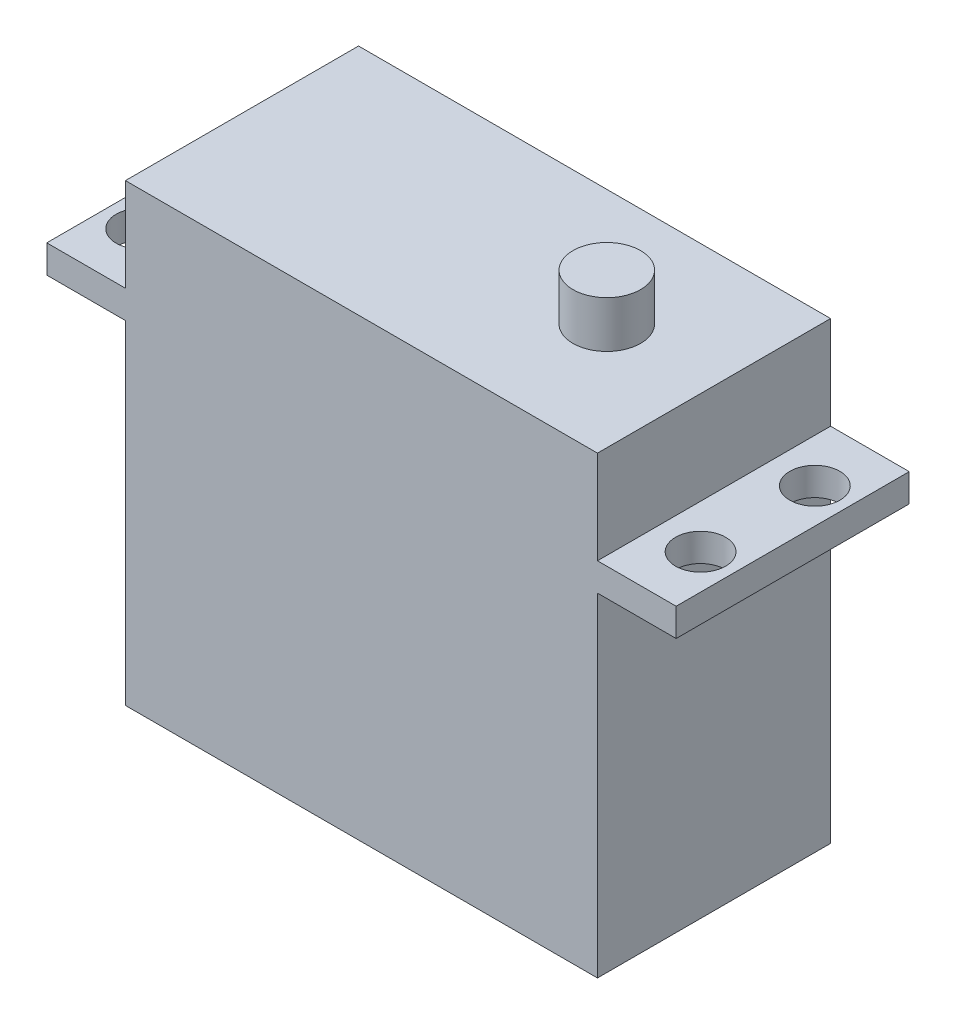
ISO-10303-21;
HEADER;
FILE_DESCRIPTION(('STEP AP214'),'2;1');
FILE_NAME('part.step','',(''),(''),'','','');
FILE_SCHEMA(('AUTOMOTIVE_DESIGN { 1 0 10303 214 1 1 1 1 }'));
ENDSEC;
DATA;
#1=APPLICATION_CONTEXT('core data for automotive mechanical design processes');
#2=APPLICATION_PROTOCOL_DEFINITION('international standard','automotive_design',2000,#1);
#3=PRODUCT_CONTEXT('',#1,'mechanical');
#4=PRODUCT('Part','Part','',(#3));
#5=PRODUCT_RELATED_PRODUCT_CATEGORY('part','',(#4));
#6=PRODUCT_DEFINITION_FORMATION('','',#4);
#7=PRODUCT_DEFINITION_CONTEXT('part definition',#1,'design');
#8=PRODUCT_DEFINITION('design','',#6,#7);
#9=PRODUCT_DEFINITION_SHAPE('','',#8);
#10=(LENGTH_UNIT() NAMED_UNIT(*) SI_UNIT(.MILLI.,.METRE.));
#11=(NAMED_UNIT(*) PLANE_ANGLE_UNIT() SI_UNIT($,.RADIAN.));
#12=(NAMED_UNIT(*) SI_UNIT($,.STERADIAN.) SOLID_ANGLE_UNIT());
#13=UNCERTAINTY_MEASURE_WITH_UNIT(LENGTH_MEASURE(1.E-05),#10,'distance_accuracy_value','');
#14=(GEOMETRIC_REPRESENTATION_CONTEXT(3) GLOBAL_UNCERTAINTY_ASSIGNED_CONTEXT((#13)) GLOBAL_UNIT_ASSIGNED_CONTEXT((#10,
#11,#12)) REPRESENTATION_CONTEXT('',''));
#15=CARTESIAN_POINT('',(0.,0.,0.));
#16=DIRECTION('',(0.,0.,1.));
#17=DIRECTION('',(1.,0.,0.));
#18=AXIS2_PLACEMENT_3D('',#15,#16,#17);
#19=CARTESIAN_POINT('',(0.,31.,0.));
#20=DIRECTION('',(0.,1.,0.));
#21=DIRECTION('',(0.,0.,1.));
#22=AXIS2_PLACEMENT_3D('',#19,#20,#21);
#23=PLANE('',#22);
#24=CARTESIAN_POINT('',(24.,31.,4.9));
#25=DIRECTION('',(0.,1.,0.));
#26=DIRECTION('',(0.,0.,-1.));
#27=AXIS2_PLACEMENT_3D('',#24,#25,#26);
#28=CIRCLE('',#27,2.15);
#29=CARTESIAN_POINT('',(24.,31.,2.75));
#30=VERTEX_POINT('',#29);
#31=EDGE_CURVE('E327',#30,#30,#28,.T.);
#32=ORIENTED_EDGE('',*,*,#31,.F.);
#33=EDGE_LOOP('',(#32));
#34=FACE_BOUND('',#33,.T.);
#35=CARTESIAN_POINT('',(24.,31.,-4.9));
#36=DIRECTION('',(0.,1.,0.));
#37=DIRECTION('',(0.,0.,1.));
#38=AXIS2_PLACEMENT_3D('',#35,#36,#37);
#39=CIRCLE('',#38,2.15);
#40=CARTESIAN_POINT('',(24.,31.,-2.75));
#41=VERTEX_POINT('',#40);
#42=EDGE_CURVE('E259',#41,#41,#39,.T.);
#43=ORIENTED_EDGE('',*,*,#42,.F.);
#44=EDGE_LOOP('',(#43));
#45=FACE_BOUND('',#44,.T.);
#46=DIRECTION('',(0.,0.,-1.));
#47=VECTOR('',#46,1.);
#48=CARTESIAN_POINT('',(20.25,31.,-10.));
#49=LINE('',#48,#47);
#50=CARTESIAN_POINT('',(20.25,31.,10.));
#51=VERTEX_POINT('',#50);
#52=CARTESIAN_POINT('',(20.25,31.,-10.));
#53=VERTEX_POINT('',#52);
#54=EDGE_CURVE('E59',#51,#53,#49,.T.);
#55=ORIENTED_EDGE('',*,*,#54,.F.);
#56=DIRECTION('',(1.,0.,0.));
#57=VECTOR('',#56,1.);
#58=CARTESIAN_POINT('',(-27.,31.,10.));
#59=LINE('',#58,#57);
#60=CARTESIAN_POINT('',(27.,31.,10.));
#61=VERTEX_POINT('',#60);
#62=EDGE_CURVE('E180',#51,#61,#59,.T.);
#63=ORIENTED_EDGE('',*,*,#62,.T.);
#64=DIRECTION('',(0.,0.,-1.));
#65=VECTOR('',#64,1.);
#66=CARTESIAN_POINT('',(27.,31.,-10.));
#67=LINE('',#66,#65);
#68=CARTESIAN_POINT('',(27.,31.,-10.));
#69=VERTEX_POINT('',#68);
#70=EDGE_CURVE('E168',#61,#69,#67,.T.);
#71=ORIENTED_EDGE('',*,*,#70,.T.);
#72=DIRECTION('',(-1.,0.,0.));
#73=VECTOR('',#72,1.);
#74=CARTESIAN_POINT('',(-27.,31.,-10.));
#75=LINE('',#74,#73);
#76=EDGE_CURVE('E174',#69,#53,#75,.T.);
#77=ORIENTED_EDGE('',*,*,#76,.T.);
#78=EDGE_LOOP('',(#55,#63,#71,#77));
#79=FACE_BOUND('',#78,.T.);
#80=ADVANCED_FACE('F41',(#34,#45,#79),#23,.T.);
#81=CARTESIAN_POINT('',(20.25,28.6,-10.));
#82=DIRECTION('',(-1.,0.,0.));
#83=DIRECTION('',(0.,0.,1.));
#84=AXIS2_PLACEMENT_3D('',#81,#82,#83);
#85=PLANE('',#84);
#86=DIRECTION('',(0.,0.,-1.));
#87=VECTOR('',#86,1.);
#88=CARTESIAN_POINT('',(20.25,0.,-10.));
#89=LINE('',#88,#87);
#90=CARTESIAN_POINT('',(20.25,0.,10.));
#91=VERTEX_POINT('',#90);
#92=CARTESIAN_POINT('',(20.25,0.,-10.));
#93=VERTEX_POINT('',#92);
#94=EDGE_CURVE('E211',#91,#93,#89,.T.);
#95=ORIENTED_EDGE('',*,*,#94,.T.);
#96=DIRECTION('',(0.,-1.,0.));
#97=VECTOR('',#96,1.);
#98=CARTESIAN_POINT('',(20.25,28.6,-10.));
#99=LINE('',#98,#97);
#100=CARTESIAN_POINT('',(20.25,28.6,-10.));
#101=VERTEX_POINT('',#100);
#102=EDGE_CURVE('E11',#101,#93,#99,.T.);
#103=ORIENTED_EDGE('',*,*,#102,.F.);
#104=DIRECTION('',(0.,0.,-1.));
#105=VECTOR('',#104,1.);
#106=CARTESIAN_POINT('',(20.25,28.6,-10.));
#107=LINE('',#106,#105);
#108=CARTESIAN_POINT('',(20.25,28.6,10.));
#109=VERTEX_POINT('',#108);
#110=EDGE_CURVE('E212',#109,#101,#107,.T.);
#111=ORIENTED_EDGE('',*,*,#110,.F.);
#112=DIRECTION('',(0.,-1.,0.));
#113=VECTOR('',#112,1.);
#114=CARTESIAN_POINT('',(20.25,28.6,10.));
#115=LINE('',#114,#113);
#116=EDGE_CURVE('E221',#109,#91,#115,.T.);
#117=ORIENTED_EDGE('',*,*,#116,.T.);
#118=EDGE_LOOP('',(#95,#103,#111,#117));
#119=FACE_BOUND('',#118,.T.);
#120=ADVANCED_FACE('F43',(#119),#85,.F.);
#121=CARTESIAN_POINT('',(-20.25,28.6,-10.));
#122=DIRECTION('',(0.,0.,1.));
#123=DIRECTION('',(1.,0.,0.));
#124=AXIS2_PLACEMENT_3D('',#121,#122,#123);
#125=PLANE('',#124);
#126=DIRECTION('',(-1.,0.,0.));
#127=VECTOR('',#126,1.);
#128=CARTESIAN_POINT('',(-20.25,0.,-10.));
#129=LINE('',#128,#127);
#130=CARTESIAN_POINT('',(-20.25,0.,-10.));
#131=VERTEX_POINT('',#130);
#132=EDGE_CURVE('E225',#93,#131,#129,.T.);
#133=ORIENTED_EDGE('',*,*,#132,.T.);
#134=DIRECTION('',(0.,-1.,0.));
#135=VECTOR('',#134,1.);
#136=CARTESIAN_POINT('',(-20.25,28.6,-10.));
#137=LINE('',#136,#135);
#138=CARTESIAN_POINT('',(-20.25,28.6,-10.));
#139=VERTEX_POINT('',#138);
#140=EDGE_CURVE('E51',#139,#131,#137,.T.);
#141=ORIENTED_EDGE('',*,*,#140,.F.);
#142=DIRECTION('',(-1.,0.,0.));
#143=VECTOR('',#142,1.);
#144=CARTESIAN_POINT('',(-27.,28.6,-10.));
#145=LINE('',#144,#143);
#146=CARTESIAN_POINT('',(-27.,28.6,-10.));
#147=VERTEX_POINT('',#146);
#148=EDGE_CURVE('E162',#139,#147,#145,.T.);
#149=ORIENTED_EDGE('',*,*,#148,.T.);
#150=DIRECTION('',(0.,-1.,0.));
#151=VECTOR('',#150,1.);
#152=CARTESIAN_POINT('',(-27.,31.,-10.));
#153=LINE('',#152,#151);
#154=CARTESIAN_POINT('',(-27.,31.,-10.));
#155=VERTEX_POINT('',#154);
#156=EDGE_CURVE('E203',#155,#147,#153,.T.);
#157=ORIENTED_EDGE('',*,*,#156,.F.);
#158=CARTESIAN_POINT('',(-20.25,31.,-10.));
#159=VERTEX_POINT('',#158);
#160=EDGE_CURVE('E172',#159,#155,#75,.T.);
#161=ORIENTED_EDGE('',*,*,#160,.F.);
#162=DIRECTION('',(0.,-1.,0.));
#163=VECTOR('',#162,1.);
#164=CARTESIAN_POINT('',(-20.25,39.,-10.));
#165=LINE('',#164,#163);
#166=CARTESIAN_POINT('',(-20.25,39.,-10.));
#167=VERTEX_POINT('',#166);
#168=EDGE_CURVE('E139',#167,#159,#165,.T.);
#169=ORIENTED_EDGE('',*,*,#168,.F.);
#170=DIRECTION('',(-1.,0.,0.));
#171=VECTOR('',#170,1.);
#172=CARTESIAN_POINT('',(-20.25,39.,-10.));
#173=LINE('',#172,#171);
#174=CARTESIAN_POINT('',(20.25,39.,-10.));
#175=VERTEX_POINT('',#174);
#176=EDGE_CURVE('E133',#175,#167,#173,.T.);
#177=ORIENTED_EDGE('',*,*,#176,.F.);
#178=DIRECTION('',(0.,-1.,0.));
#179=VECTOR('',#178,1.);
#180=CARTESIAN_POINT('',(20.25,39.,-10.));
#181=LINE('',#180,#179);
#182=EDGE_CURVE('E137',#175,#53,#181,.T.);
#183=ORIENTED_EDGE('',*,*,#182,.T.);
#184=ORIENTED_EDGE('',*,*,#76,.F.);
#185=DIRECTION('',(0.,-1.,0.));
#186=VECTOR('',#185,1.);
#187=CARTESIAN_POINT('',(27.,31.,-10.));
#188=LINE('',#187,#186);
#189=CARTESIAN_POINT('',(27.,28.6,-10.));
#190=VERTEX_POINT('',#189);
#191=EDGE_CURVE('E207',#69,#190,#188,.T.);
#192=ORIENTED_EDGE('',*,*,#191,.T.);
#193=EDGE_CURVE('E185',#190,#101,#145,.T.);
#194=ORIENTED_EDGE('',*,*,#193,.T.);
#195=ORIENTED_EDGE('',*,*,#102,.T.);
#196=EDGE_LOOP('',(#133,#141,#149,#157,#161,#169,#177,#183,#184,#192,#194,#195));
#197=FACE_BOUND('',#196,.T.);
#198=ADVANCED_FACE('F135',(#197),#125,.F.);
#199=CARTESIAN_POINT('',(-20.25,28.6,-10.));
#200=DIRECTION('',(1.,0.,0.));
#201=DIRECTION('',(0.,0.,-1.));
#202=AXIS2_PLACEMENT_3D('',#199,#200,#201);
#203=PLANE('',#202);
#204=DIRECTION('',(0.,0.,1.));
#205=VECTOR('',#204,1.);
#206=CARTESIAN_POINT('',(-20.25,0.,-10.));
#207=LINE('',#206,#205);
#208=CARTESIAN_POINT('',(-20.25,0.,10.));
#209=VERTEX_POINT('',#208);
#210=EDGE_CURVE('E228',#131,#209,#207,.T.);
#211=ORIENTED_EDGE('',*,*,#210,.T.);
#212=DIRECTION('',(0.,-1.,0.));
#213=VECTOR('',#212,1.);
#214=CARTESIAN_POINT('',(-20.25,28.6,10.));
#215=LINE('',#214,#213);
#216=CARTESIAN_POINT('',(-20.25,28.6,10.));
#217=VERTEX_POINT('',#216);
#218=EDGE_CURVE('E236',#217,#209,#215,.T.);
#219=ORIENTED_EDGE('',*,*,#218,.F.);
#220=DIRECTION('',(0.,0.,1.));
#221=VECTOR('',#220,1.);
#222=CARTESIAN_POINT('',(-20.25,28.6,-10.));
#223=LINE('',#222,#221);
#224=EDGE_CURVE('E216',#139,#217,#223,.T.);
#225=ORIENTED_EDGE('',*,*,#224,.F.);
#226=ORIENTED_EDGE('',*,*,#140,.T.);
#227=EDGE_LOOP('',(#211,#219,#225,#226));
#228=FACE_BOUND('',#227,.T.);
#229=ADVANCED_FACE('F422',(#228),#203,.F.);
#230=CARTESIAN_POINT('',(-20.25,28.6,10.));
#231=DIRECTION('',(0.,0.,-1.));
#232=DIRECTION('',(-1.,0.,0.));
#233=AXIS2_PLACEMENT_3D('',#230,#231,#232);
#234=PLANE('',#233);
#235=DIRECTION('',(1.,0.,0.));
#236=VECTOR('',#235,1.);
#237=CARTESIAN_POINT('',(-20.25,0.,10.));
#238=LINE('',#237,#236);
#239=EDGE_CURVE('E217',#209,#91,#238,.T.);
#240=ORIENTED_EDGE('',*,*,#239,.T.);
#241=ORIENTED_EDGE('',*,*,#116,.F.);
#242=DIRECTION('',(1.,0.,0.));
#243=VECTOR('',#242,1.);
#244=CARTESIAN_POINT('',(-27.,28.6,10.));
#245=LINE('',#244,#243);
#246=CARTESIAN_POINT('',(27.,28.6,10.));
#247=VERTEX_POINT('',#246);
#248=EDGE_CURVE('E192',#109,#247,#245,.T.);
#249=ORIENTED_EDGE('',*,*,#248,.T.);
#250=DIRECTION('',(0.,-1.,0.));
#251=VECTOR('',#250,1.);
#252=CARTESIAN_POINT('',(27.,31.,10.));
#253=LINE('',#252,#251);
#254=EDGE_CURVE('E183',#61,#247,#253,.T.);
#255=ORIENTED_EDGE('',*,*,#254,.F.);
#256=ORIENTED_EDGE('',*,*,#62,.F.);
#257=DIRECTION('',(0.,-1.,0.));
#258=VECTOR('',#257,1.);
#259=CARTESIAN_POINT('',(20.25,39.,10.));
#260=LINE('',#259,#258);
#261=CARTESIAN_POINT('',(20.25,39.,10.));
#262=VERTEX_POINT('',#261);
#263=EDGE_CURVE('E274',#262,#51,#260,.T.);
#264=ORIENTED_EDGE('',*,*,#263,.F.);
#265=DIRECTION('',(1.,0.,0.));
#266=VECTOR('',#265,1.);
#267=CARTESIAN_POINT('',(-20.25,39.,10.));
#268=LINE('',#267,#266);
#269=CARTESIAN_POINT('',(-20.25,39.,10.));
#270=VERTEX_POINT('',#269);
#271=EDGE_CURVE('E149',#270,#262,#268,.T.);
#272=ORIENTED_EDGE('',*,*,#271,.F.);
#273=DIRECTION('',(0.,-1.,0.));
#274=VECTOR('',#273,1.);
#275=CARTESIAN_POINT('',(-20.25,39.,10.));
#276=LINE('',#275,#274);
#277=CARTESIAN_POINT('',(-20.25,31.,10.));
#278=VERTEX_POINT('',#277);
#279=EDGE_CURVE('E164',#270,#278,#276,.T.);
#280=ORIENTED_EDGE('',*,*,#279,.T.);
#281=CARTESIAN_POINT('',(-27.,31.,10.));
#282=VERTEX_POINT('',#281);
#283=EDGE_CURVE('E181',#282,#278,#59,.T.);
#284=ORIENTED_EDGE('',*,*,#283,.F.);
#285=DIRECTION('',(0.,-1.,0.));
#286=VECTOR('',#285,1.);
#287=CARTESIAN_POINT('',(-27.,31.,10.));
#288=LINE('',#287,#286);
#289=CARTESIAN_POINT('',(-27.,28.6,10.));
#290=VERTEX_POINT('',#289);
#291=EDGE_CURVE('E199',#282,#290,#288,.T.);
#292=ORIENTED_EDGE('',*,*,#291,.T.);
#293=EDGE_CURVE('E173',#290,#217,#245,.T.);
#294=ORIENTED_EDGE('',*,*,#293,.T.);
#295=ORIENTED_EDGE('',*,*,#218,.T.);
#296=EDGE_LOOP('',(#240,#241,#249,#255,#256,#264,#272,#280,#284,#292,#294,#295));
#297=FACE_BOUND('',#296,.T.);
#298=ADVANCED_FACE('F285',(#297),#234,.F.);
#299=CARTESIAN_POINT('',(0.,0.,0.));
#300=DIRECTION('',(0.,1.,0.));
#301=DIRECTION('',(0.,0.,1.));
#302=AXIS2_PLACEMENT_3D('',#299,#300,#301);
#303=PLANE('',#302);
#304=ORIENTED_EDGE('',*,*,#94,.F.);
#305=ORIENTED_EDGE('',*,*,#239,.F.);
#306=ORIENTED_EDGE('',*,*,#210,.F.);
#307=ORIENTED_EDGE('',*,*,#132,.F.);
#308=EDGE_LOOP('',(#304,#305,#306,#307));
#309=FACE_BOUND('',#308,.T.);
#310=ADVANCED_FACE('F421',(#309),#303,.F.);
#311=CARTESIAN_POINT('',(0.,28.6,0.));
#312=DIRECTION('',(0.,1.,0.));
#313=DIRECTION('',(0.,0.,1.));
#314=AXIS2_PLACEMENT_3D('',#311,#312,#313);
#315=PLANE('',#314);
#316=CARTESIAN_POINT('',(24.,28.6,4.9));
#317=DIRECTION('',(0.,1.,0.));
#318=DIRECTION('',(0.,0.,1.));
#319=AXIS2_PLACEMENT_3D('',#316,#317,#318);
#320=CIRCLE('',#319,2.15);
#321=CARTESIAN_POINT('',(24.,28.6,7.05));
#322=VERTEX_POINT('',#321);
#323=EDGE_CURVE('E45',#322,#322,#320,.T.);
#324=ORIENTED_EDGE('',*,*,#323,.T.);
#325=EDGE_LOOP('',(#324));
#326=FACE_BOUND('',#325,.T.);
#327=CARTESIAN_POINT('',(24.,28.6,-4.9));
#328=DIRECTION('',(0.,1.,0.));
#329=DIRECTION('',(0.,0.,1.));
#330=AXIS2_PLACEMENT_3D('',#327,#328,#329);
#331=CIRCLE('',#330,2.15);
#332=CARTESIAN_POINT('',(24.,28.6,-2.75));
#333=VERTEX_POINT('',#332);
#334=EDGE_CURVE('E242',#333,#333,#331,.T.);
#335=ORIENTED_EDGE('',*,*,#334,.T.);
#336=EDGE_LOOP('',(#335));
#337=FACE_BOUND('',#336,.T.);
#338=ORIENTED_EDGE('',*,*,#248,.F.);
#339=ORIENTED_EDGE('',*,*,#110,.T.);
#340=ORIENTED_EDGE('',*,*,#193,.F.);
#341=DIRECTION('',(0.,0.,-1.));
#342=VECTOR('',#341,1.);
#343=CARTESIAN_POINT('',(27.,28.6,-10.));
#344=LINE('',#343,#342);
#345=EDGE_CURVE('E157',#247,#190,#344,.T.);
#346=ORIENTED_EDGE('',*,*,#345,.F.);
#347=EDGE_LOOP('',(#338,#339,#340,#346));
#348=FACE_BOUND('',#347,.T.);
#349=ADVANCED_FACE('F468',(#326,#337,#348),#315,.F.);
#350=CARTESIAN_POINT('',(-24.,28.6,-4.9));
#351=DIRECTION('',(0.,1.,0.));
#352=DIRECTION('',(0.,0.,1.));
#353=AXIS2_PLACEMENT_3D('',#350,#351,#352);
#354=CIRCLE('',#353,2.15);
#355=CARTESIAN_POINT('',(-24.,28.6,-2.75));
#356=VERTEX_POINT('',#355);
#357=EDGE_CURVE('E245',#356,#356,#354,.T.);
#358=ORIENTED_EDGE('',*,*,#357,.T.);
#359=EDGE_LOOP('',(#358));
#360=FACE_BOUND('',#359,.T.);
#361=CARTESIAN_POINT('',(-24.,28.6,4.9));
#362=DIRECTION('',(0.,1.,0.));
#363=DIRECTION('',(0.,0.,1.));
#364=AXIS2_PLACEMENT_3D('',#361,#362,#363);
#365=CIRCLE('',#364,2.15);
#366=CARTESIAN_POINT('',(-24.,28.6,7.05));
#367=VERTEX_POINT('',#366);
#368=EDGE_CURVE('E253',#367,#367,#365,.T.);
#369=ORIENTED_EDGE('',*,*,#368,.T.);
#370=EDGE_LOOP('',(#369));
#371=FACE_BOUND('',#370,.T.);
#372=ORIENTED_EDGE('',*,*,#148,.F.);
#373=ORIENTED_EDGE('',*,*,#224,.T.);
#374=ORIENTED_EDGE('',*,*,#293,.F.);
#375=DIRECTION('',(0.,0.,1.));
#376=VECTOR('',#375,1.);
#377=CARTESIAN_POINT('',(-27.,28.6,-10.));
#378=LINE('',#377,#376);
#379=EDGE_CURVE('E189',#147,#290,#378,.T.);
#380=ORIENTED_EDGE('',*,*,#379,.F.);
#381=EDGE_LOOP('',(#372,#373,#374,#380));
#382=FACE_BOUND('',#381,.T.);
#383=ADVANCED_FACE('F460',(#360,#371,#382),#315,.F.);
#384=CARTESIAN_POINT('',(27.,31.,-10.));
#385=DIRECTION('',(-1.,0.,0.));
#386=DIRECTION('',(0.,0.,1.));
#387=AXIS2_PLACEMENT_3D('',#384,#385,#386);
#388=PLANE('',#387);
#389=ORIENTED_EDGE('',*,*,#345,.T.);
#390=ORIENTED_EDGE('',*,*,#191,.F.);
#391=ORIENTED_EDGE('',*,*,#70,.F.);
#392=ORIENTED_EDGE('',*,*,#254,.T.);
#393=EDGE_LOOP('',(#389,#390,#391,#392));
#394=FACE_BOUND('',#393,.T.);
#395=ADVANCED_FACE('F315',(#394),#388,.F.);
#396=CARTESIAN_POINT('',(-27.,31.,-10.));
#397=DIRECTION('',(1.,0.,0.));
#398=DIRECTION('',(0.,0.,-1.));
#399=AXIS2_PLACEMENT_3D('',#396,#397,#398);
#400=PLANE('',#399);
#401=ORIENTED_EDGE('',*,*,#379,.T.);
#402=ORIENTED_EDGE('',*,*,#291,.F.);
#403=DIRECTION('',(0.,0.,1.));
#404=VECTOR('',#403,1.);
#405=CARTESIAN_POINT('',(-27.,31.,-10.));
#406=LINE('',#405,#404);
#407=EDGE_CURVE('E177',#155,#282,#406,.T.);
#408=ORIENTED_EDGE('',*,*,#407,.F.);
#409=ORIENTED_EDGE('',*,*,#156,.T.);
#410=EDGE_LOOP('',(#401,#402,#408,#409));
#411=FACE_BOUND('',#410,.T.);
#412=ADVANCED_FACE('F310',(#411),#400,.F.);
#413=CARTESIAN_POINT('',(-24.,31.,-4.9));
#414=DIRECTION('',(0.,1.,0.));
#415=DIRECTION('',(0.,0.,-1.));
#416=AXIS2_PLACEMENT_3D('',#413,#414,#415);
#417=CIRCLE('',#416,2.15);
#418=CARTESIAN_POINT('',(-24.,31.,-7.05));
#419=VERTEX_POINT('',#418);
#420=EDGE_CURVE('E321',#419,#419,#417,.T.);
#421=ORIENTED_EDGE('',*,*,#420,.F.);
#422=EDGE_LOOP('',(#421));
#423=FACE_BOUND('',#422,.T.);
#424=CARTESIAN_POINT('',(-24.,31.,4.9));
#425=DIRECTION('',(0.,1.,0.));
#426=DIRECTION('',(0.,0.,1.));
#427=AXIS2_PLACEMENT_3D('',#424,#425,#426);
#428=CIRCLE('',#427,2.15);
#429=CARTESIAN_POINT('',(-24.,31.,7.05));
#430=VERTEX_POINT('',#429);
#431=EDGE_CURVE('E324',#430,#430,#428,.T.);
#432=ORIENTED_EDGE('',*,*,#431,.F.);
#433=EDGE_LOOP('',(#432));
#434=FACE_BOUND('',#433,.T.);
#435=DIRECTION('',(0.,0.,1.));
#436=VECTOR('',#435,1.);
#437=CARTESIAN_POINT('',(-20.25,31.,-10.));
#438=LINE('',#437,#436);
#439=EDGE_CURVE('E67',#159,#278,#438,.T.);
#440=ORIENTED_EDGE('',*,*,#439,.F.);
#441=ORIENTED_EDGE('',*,*,#160,.T.);
#442=ORIENTED_EDGE('',*,*,#407,.T.);
#443=ORIENTED_EDGE('',*,*,#283,.T.);
#444=EDGE_LOOP('',(#440,#441,#442,#443));
#445=FACE_BOUND('',#444,.T.);
#446=ADVANCED_FACE('F297',(#423,#434,#445),#23,.T.);
#447=CARTESIAN_POINT('',(20.25,39.,-10.));
#448=DIRECTION('',(-1.,0.,0.));
#449=DIRECTION('',(0.,0.,1.));
#450=AXIS2_PLACEMENT_3D('',#447,#448,#449);
#451=PLANE('',#450);
#452=ORIENTED_EDGE('',*,*,#54,.T.);
#453=ORIENTED_EDGE('',*,*,#182,.F.);
#454=DIRECTION('',(0.,0.,-1.));
#455=VECTOR('',#454,1.);
#456=CARTESIAN_POINT('',(20.25,39.,-10.));
#457=LINE('',#456,#455);
#458=EDGE_CURVE('E144',#262,#175,#457,.T.);
#459=ORIENTED_EDGE('',*,*,#458,.F.);
#460=ORIENTED_EDGE('',*,*,#263,.T.);
#461=EDGE_LOOP('',(#452,#453,#459,#460));
#462=FACE_BOUND('',#461,.T.);
#463=ADVANCED_FACE('F155',(#462),#451,.F.);
#464=CARTESIAN_POINT('',(-20.25,39.,-10.));
#465=DIRECTION('',(1.,0.,0.));
#466=DIRECTION('',(0.,0.,-1.));
#467=AXIS2_PLACEMENT_3D('',#464,#465,#466);
#468=PLANE('',#467);
#469=ORIENTED_EDGE('',*,*,#439,.T.);
#470=ORIENTED_EDGE('',*,*,#279,.F.);
#471=DIRECTION('',(0.,0.,1.));
#472=VECTOR('',#471,1.);
#473=CARTESIAN_POINT('',(-20.25,39.,-10.));
#474=LINE('',#473,#472);
#475=EDGE_CURVE('E143',#167,#270,#474,.T.);
#476=ORIENTED_EDGE('',*,*,#475,.F.);
#477=ORIENTED_EDGE('',*,*,#168,.T.);
#478=EDGE_LOOP('',(#469,#470,#476,#477));
#479=FACE_BOUND('',#478,.T.);
#480=ADVANCED_FACE('F287',(#479),#468,.F.);
#481=CARTESIAN_POINT('',(0.,39.,0.));
#482=DIRECTION('',(0.,1.,0.));
#483=DIRECTION('',(0.,0.,1.));
#484=AXIS2_PLACEMENT_3D('',#481,#482,#483);
#485=PLANE('',#484);
#486=CARTESIAN_POINT('',(11.05,39.,0.));
#487=DIRECTION('',(0.,1.,0.));
#488=DIRECTION('',(0.,0.,1.));
#489=AXIS2_PLACEMENT_3D('',#486,#487,#488);
#490=CIRCLE('',#489,2.9);
#491=CARTESIAN_POINT('',(11.05,39.,2.9));
#492=VERTEX_POINT('',#491);
#493=EDGE_CURVE('E251',#492,#492,#490,.T.);
#494=ORIENTED_EDGE('',*,*,#493,.F.);
#495=EDGE_LOOP('',(#494));
#496=FACE_BOUND('',#495,.T.);
#497=ORIENTED_EDGE('',*,*,#458,.T.);
#498=ORIENTED_EDGE('',*,*,#176,.T.);
#499=ORIENTED_EDGE('',*,*,#475,.T.);
#500=ORIENTED_EDGE('',*,*,#271,.T.);
#501=EDGE_LOOP('',(#497,#498,#499,#500));
#502=FACE_BOUND('',#501,.T.);
#503=ADVANCED_FACE('F147',(#496,#502),#485,.T.);
#504=CARTESIAN_POINT('',(11.05,43.,0.));
#505=DIRECTION('',(0.,-1.,0.));
#506=DIRECTION('',(0.,0.,-1.));
#507=AXIS2_PLACEMENT_3D('',#504,#505,#506);
#508=CYLINDRICAL_SURFACE('',#507,2.9);
#509=CARTESIAN_POINT('',(11.05,43.,0.));
#510=DIRECTION('',(0.,1.,0.));
#511=DIRECTION('',(0.,0.,1.));
#512=AXIS2_PLACEMENT_3D('',#509,#510,#511);
#513=CIRCLE('',#512,2.9);
#514=CARTESIAN_POINT('',(11.05,43.,2.9));
#515=VERTEX_POINT('',#514);
#516=EDGE_CURVE('E263',#515,#515,#513,.T.);
#517=ORIENTED_EDGE('',*,*,#516,.F.);
#518=EDGE_LOOP('',(#517));
#519=FACE_BOUND('',#518,.T.);
#520=ORIENTED_EDGE('',*,*,#493,.T.);
#521=EDGE_LOOP('',(#520));
#522=FACE_BOUND('',#521,.T.);
#523=ADVANCED_FACE('F294',(#519,#522),#508,.T.);
#524=CARTESIAN_POINT('',(11.05,43.,0.));
#525=DIRECTION('',(0.,1.,0.));
#526=DIRECTION('',(0.,0.,1.));
#527=AXIS2_PLACEMENT_3D('',#524,#525,#526);
#528=PLANE('',#527);
#529=ORIENTED_EDGE('',*,*,#516,.T.);
#530=EDGE_LOOP('',(#529));
#531=FACE_BOUND('',#530,.T.);
#532=ADVANCED_FACE('F355',(#531),#528,.T.);
#533=CARTESIAN_POINT('',(-24.,0.,4.9));
#534=DIRECTION('',(0.,1.,0.));
#535=DIRECTION('',(0.,0.,1.));
#536=AXIS2_PLACEMENT_3D('',#533,#534,#535);
#537=CYLINDRICAL_SURFACE('',#536,2.15);
#538=ORIENTED_EDGE('',*,*,#431,.T.);
#539=EDGE_LOOP('',(#538));
#540=FACE_BOUND('',#539,.T.);
#541=ORIENTED_EDGE('',*,*,#368,.F.);
#542=EDGE_LOOP('',(#541));
#543=FACE_BOUND('',#542,.T.);
#544=ADVANCED_FACE('F350',(#540,#543),#537,.F.);
#545=CARTESIAN_POINT('',(-24.,0.,-4.9));
#546=DIRECTION('',(0.,1.,0.));
#547=DIRECTION('',(0.,0.,1.));
#548=AXIS2_PLACEMENT_3D('',#545,#546,#547);
#549=CYLINDRICAL_SURFACE('',#548,2.15);
#550=ORIENTED_EDGE('',*,*,#420,.T.);
#551=EDGE_LOOP('',(#550));
#552=FACE_BOUND('',#551,.T.);
#553=ORIENTED_EDGE('',*,*,#357,.F.);
#554=EDGE_LOOP('',(#553));
#555=FACE_BOUND('',#554,.T.);
#556=ADVANCED_FACE('F342',(#552,#555),#549,.F.);
#557=CARTESIAN_POINT('',(24.,0.,-4.9));
#558=DIRECTION('',(0.,1.,0.));
#559=DIRECTION('',(0.,0.,1.));
#560=AXIS2_PLACEMENT_3D('',#557,#558,#559);
#561=CYLINDRICAL_SURFACE('',#560,2.15);
#562=ORIENTED_EDGE('',*,*,#42,.T.);
#563=EDGE_LOOP('',(#562));
#564=FACE_BOUND('',#563,.T.);
#565=ORIENTED_EDGE('',*,*,#334,.F.);
#566=EDGE_LOOP('',(#565));
#567=FACE_BOUND('',#566,.T.);
#568=ADVANCED_FACE('F338',(#564,#567),#561,.F.);
#569=CARTESIAN_POINT('',(24.,0.,4.9));
#570=DIRECTION('',(0.,1.,0.));
#571=DIRECTION('',(0.,0.,1.));
#572=AXIS2_PLACEMENT_3D('',#569,#570,#571);
#573=CYLINDRICAL_SURFACE('',#572,2.15);
#574=ORIENTED_EDGE('',*,*,#31,.T.);
#575=EDGE_LOOP('',(#574));
#576=FACE_BOUND('',#575,.T.);
#577=ORIENTED_EDGE('',*,*,#323,.F.);
#578=EDGE_LOOP('',(#577));
#579=FACE_BOUND('',#578,.T.);
#580=ADVANCED_FACE('F341',(#576,#579),#573,.F.);
#581=CLOSED_SHELL('',(#80,#120,#198,#229,#298,#310,#349,#383,#395,#412,#446,#463,#480,#503,#523,
#532,#544,#556,#568,#580));
#582=MANIFOLD_SOLID_BREP('B2',#581);
#583=ADVANCED_BREP_SHAPE_REPRESENTATION('',(#18,#582),#14);
#584=SHAPE_DEFINITION_REPRESENTATION(#9,#583);
ENDSEC;
END-ISO-10303-21;
